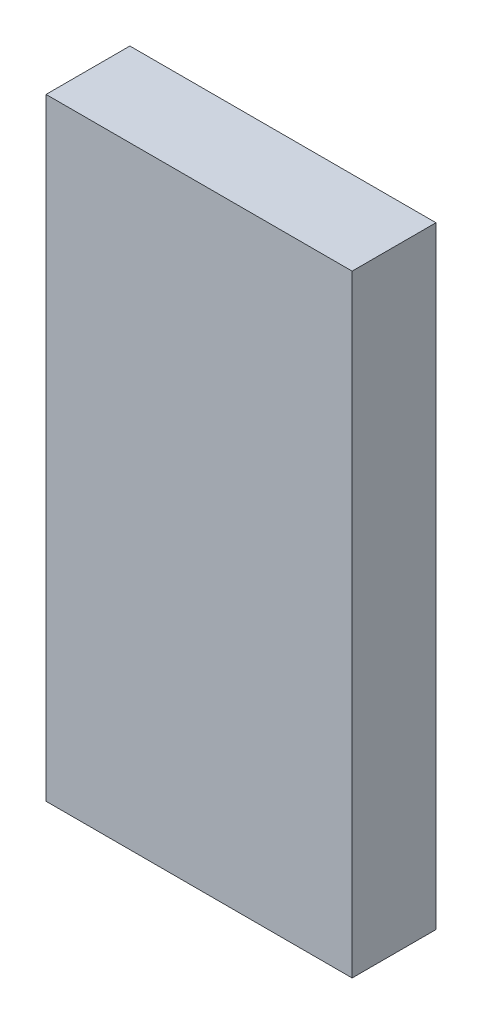
ISO-10303-21;
HEADER;
FILE_DESCRIPTION(('STEP AP214'),'2;1');
FILE_NAME('part.step','',(''),(''),'','','');
FILE_SCHEMA(('AUTOMOTIVE_DESIGN { 1 0 10303 214 1 1 1 1 }'));
ENDSEC;
DATA;
#1=APPLICATION_CONTEXT('core data for automotive mechanical design processes');
#2=APPLICATION_PROTOCOL_DEFINITION('international standard','automotive_design',2000,#1);
#3=PRODUCT_CONTEXT('',#1,'mechanical');
#4=PRODUCT('Part','Part','',(#3));
#5=PRODUCT_RELATED_PRODUCT_CATEGORY('part','',(#4));
#6=PRODUCT_DEFINITION_FORMATION('','',#4);
#7=PRODUCT_DEFINITION_CONTEXT('part definition',#1,'design');
#8=PRODUCT_DEFINITION('design','',#6,#7);
#9=PRODUCT_DEFINITION_SHAPE('','',#8);
#10=(LENGTH_UNIT() NAMED_UNIT(*) SI_UNIT(.MILLI.,.METRE.));
#11=(NAMED_UNIT(*) PLANE_ANGLE_UNIT() SI_UNIT($,.RADIAN.));
#12=(NAMED_UNIT(*) SI_UNIT($,.STERADIAN.) SOLID_ANGLE_UNIT());
#13=UNCERTAINTY_MEASURE_WITH_UNIT(LENGTH_MEASURE(1.E-05),#10,'distance_accuracy_value','');
#14=(GEOMETRIC_REPRESENTATION_CONTEXT(3) GLOBAL_UNCERTAINTY_ASSIGNED_CONTEXT((#13)) GLOBAL_UNIT_ASSIGNED_CONTEXT((#10,
#11,#12)) REPRESENTATION_CONTEXT('',''));
#15=CARTESIAN_POINT('',(0.,0.,0.));
#16=DIRECTION('',(0.,0.,1.));
#17=DIRECTION('',(1.,0.,0.));
#18=AXIS2_PLACEMENT_3D('',#15,#16,#17);
#19=CARTESIAN_POINT('',(0.2921,-0.5842,0.15999968));
#20=DIRECTION('',(0.,0.,-1.));
#21=DIRECTION('',(0.,-1.,0.));
#22=AXIS2_PLACEMENT_3D('',#19,#20,#21);
#23=PLANE('',#22);
#24=DIRECTION('',(0.,1.,0.));
#25=VECTOR('',#24,1.);
#26=CARTESIAN_POINT('',(0.2921,-0.5842,0.15999968));
#27=LINE('',#26,#25);
#28=CARTESIAN_POINT('',(0.2921,-0.5842,0.15999968));
#29=VERTEX_POINT('',#28);
#30=CARTESIAN_POINT('',(0.2921,0.5842,0.15999968));
#31=VERTEX_POINT('',#30);
#32=EDGE_CURVE('E80',#29,#31,#27,.T.);
#33=ORIENTED_EDGE('',*,*,#32,.T.);
#34=DIRECTION('',(-1.,0.,0.));
#35=VECTOR('',#34,1.);
#36=CARTESIAN_POINT('',(0.2921,0.5842,0.15999968));
#37=LINE('',#36,#35);
#38=CARTESIAN_POINT('',(-0.2921,0.5842,0.15999968));
#39=VERTEX_POINT('',#38);
#40=EDGE_CURVE('E67',#31,#39,#37,.T.);
#41=ORIENTED_EDGE('',*,*,#40,.T.);
#42=DIRECTION('',(0.,-1.,0.));
#43=VECTOR('',#42,1.);
#44=CARTESIAN_POINT('',(-0.2921,0.5842,0.15999968));
#45=LINE('',#44,#43);
#46=CARTESIAN_POINT('',(-0.2921,-0.5842,0.15999968));
#47=VERTEX_POINT('',#46);
#48=EDGE_CURVE('E100',#39,#47,#45,.T.);
#49=ORIENTED_EDGE('',*,*,#48,.T.);
#50=DIRECTION('',(1.,0.,0.));
#51=VECTOR('',#50,1.);
#52=CARTESIAN_POINT('',(-0.2921,-0.5842,0.15999968));
#53=LINE('',#52,#51);
#54=EDGE_CURVE('E11',#47,#29,#53,.T.);
#55=ORIENTED_EDGE('',*,*,#54,.T.);
#56=EDGE_LOOP('',(#33,#41,#49,#55));
#57=FACE_BOUND('',#56,.T.);
#58=ADVANCED_FACE('F17',(#57),#23,.F.);
#59=CARTESIAN_POINT('',(0.2921,-0.5842,0.));
#60=DIRECTION('',(0.,0.,-1.));
#61=DIRECTION('',(0.,-1.,0.));
#62=AXIS2_PLACEMENT_3D('',#59,#60,#61);
#63=PLANE('',#62);
#64=DIRECTION('',(0.,1.,0.));
#65=VECTOR('',#64,1.);
#66=CARTESIAN_POINT('',(0.2921,-0.5842,0.));
#67=LINE('',#66,#65);
#68=CARTESIAN_POINT('',(0.2921,-0.5842,0.));
#69=VERTEX_POINT('',#68);
#70=CARTESIAN_POINT('',(0.2921,0.5842,0.));
#71=VERTEX_POINT('',#70);
#72=EDGE_CURVE('E88',#69,#71,#67,.T.);
#73=ORIENTED_EDGE('',*,*,#72,.F.);
#74=DIRECTION('',(1.,0.,0.));
#75=VECTOR('',#74,1.);
#76=CARTESIAN_POINT('',(-0.2921,-0.5842,0.));
#77=LINE('',#76,#75);
#78=CARTESIAN_POINT('',(-0.2921,-0.5842,0.));
#79=VERTEX_POINT('',#78);
#80=EDGE_CURVE('E28',#79,#69,#77,.T.);
#81=ORIENTED_EDGE('',*,*,#80,.F.);
#82=DIRECTION('',(0.,-1.,0.));
#83=VECTOR('',#82,1.);
#84=CARTESIAN_POINT('',(-0.2921,0.5842,0.));
#85=LINE('',#84,#83);
#86=CARTESIAN_POINT('',(-0.2921,0.5842,0.));
#87=VERTEX_POINT('',#86);
#88=EDGE_CURVE('E77',#87,#79,#85,.T.);
#89=ORIENTED_EDGE('',*,*,#88,.F.);
#90=DIRECTION('',(-1.,0.,0.));
#91=VECTOR('',#90,1.);
#92=CARTESIAN_POINT('',(0.2921,0.5842,0.));
#93=LINE('',#92,#91);
#94=EDGE_CURVE('E84',#71,#87,#93,.T.);
#95=ORIENTED_EDGE('',*,*,#94,.F.);
#96=EDGE_LOOP('',(#73,#81,#89,#95));
#97=FACE_BOUND('',#96,.T.);
#98=ADVANCED_FACE('F114',(#97),#63,.T.);
#99=CARTESIAN_POINT('',(-0.2921,-0.5842,0.));
#100=DIRECTION('',(0.,1.,0.));
#101=DIRECTION('',(1.,0.,0.));
#102=AXIS2_PLACEMENT_3D('',#99,#100,#101);
#103=PLANE('',#102);
#104=DIRECTION('',(0.,0.,1.));
#105=VECTOR('',#104,1.);
#106=CARTESIAN_POINT('',(-0.2921,-0.5842,0.));
#107=LINE('',#106,#105);
#108=EDGE_CURVE('E21',#79,#47,#107,.T.);
#109=ORIENTED_EDGE('',*,*,#108,.F.);
#110=ORIENTED_EDGE('',*,*,#80,.T.);
#111=DIRECTION('',(0.,0.,1.));
#112=VECTOR('',#111,1.);
#113=CARTESIAN_POINT('',(0.2921,-0.5842,0.));
#114=LINE('',#113,#112);
#115=EDGE_CURVE('E95',#69,#29,#114,.T.);
#116=ORIENTED_EDGE('',*,*,#115,.T.);
#117=ORIENTED_EDGE('',*,*,#54,.F.);
#118=EDGE_LOOP('',(#109,#110,#116,#117));
#119=FACE_BOUND('',#118,.T.);
#120=ADVANCED_FACE('F111',(#119),#103,.F.);
#121=CARTESIAN_POINT('',(-0.2921,0.5842,0.));
#122=DIRECTION('',(1.,0.,0.));
#123=DIRECTION('',(0.,1.,0.));
#124=AXIS2_PLACEMENT_3D('',#121,#122,#123);
#125=PLANE('',#124);
#126=DIRECTION('',(0.,0.,1.));
#127=VECTOR('',#126,1.);
#128=CARTESIAN_POINT('',(-0.2921,0.5842,0.));
#129=LINE('',#128,#127);
#130=EDGE_CURVE('E74',#87,#39,#129,.T.);
#131=ORIENTED_EDGE('',*,*,#130,.F.);
#132=ORIENTED_EDGE('',*,*,#88,.T.);
#133=ORIENTED_EDGE('',*,*,#108,.T.);
#134=ORIENTED_EDGE('',*,*,#48,.F.);
#135=EDGE_LOOP('',(#131,#132,#133,#134));
#136=FACE_BOUND('',#135,.T.);
#137=ADVANCED_FACE('F166',(#136),#125,.F.);
#138=CARTESIAN_POINT('',(0.2921,0.5842,0.));
#139=DIRECTION('',(0.,-1.,0.));
#140=DIRECTION('',(0.,0.,-1.));
#141=AXIS2_PLACEMENT_3D('',#138,#139,#140);
#142=PLANE('',#141);
#143=DIRECTION('',(0.,0.,1.));
#144=VECTOR('',#143,1.);
#145=CARTESIAN_POINT('',(0.2921,0.5842,0.));
#146=LINE('',#145,#144);
#147=EDGE_CURVE('E71',#71,#31,#146,.T.);
#148=ORIENTED_EDGE('',*,*,#147,.F.);
#149=ORIENTED_EDGE('',*,*,#94,.T.);
#150=ORIENTED_EDGE('',*,*,#130,.T.);
#151=ORIENTED_EDGE('',*,*,#40,.F.);
#152=EDGE_LOOP('',(#148,#149,#150,#151));
#153=FACE_BOUND('',#152,.T.);
#154=ADVANCED_FACE('F19',(#153),#142,.F.);
#155=CARTESIAN_POINT('',(0.2921,-0.5842,0.));
#156=DIRECTION('',(-1.,0.,0.));
#157=DIRECTION('',(0.,0.,1.));
#158=AXIS2_PLACEMENT_3D('',#155,#156,#157);
#159=PLANE('',#158);
#160=ORIENTED_EDGE('',*,*,#115,.F.);
#161=ORIENTED_EDGE('',*,*,#72,.T.);
#162=ORIENTED_EDGE('',*,*,#147,.T.);
#163=ORIENTED_EDGE('',*,*,#32,.F.);
#164=EDGE_LOOP('',(#160,#161,#162,#163));
#165=FACE_BOUND('',#164,.T.);
#166=ADVANCED_FACE('F86',(#165),#159,.F.);
#167=CLOSED_SHELL('',(#58,#98,#120,#137,#154,#166));
#168=MANIFOLD_SOLID_BREP('B1',#167);
#169=ADVANCED_BREP_SHAPE_REPRESENTATION('',(#18,#168),#14);
#170=SHAPE_DEFINITION_REPRESENTATION(#9,#169);
ENDSEC;
END-ISO-10303-21;
